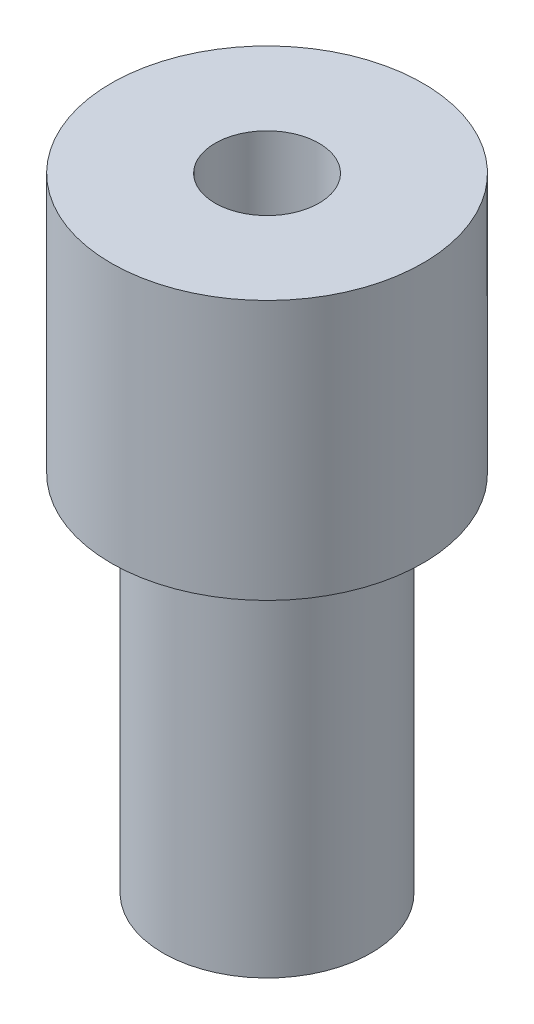
ISO-10303-21;
HEADER;
FILE_DESCRIPTION(('STEP AP214'),'2;1');
FILE_NAME('part.step','',(''),(''),'','','');
FILE_SCHEMA(('AUTOMOTIVE_DESIGN { 1 0 10303 214 1 1 1 1 }'));
ENDSEC;
DATA;
#1=APPLICATION_CONTEXT('core data for automotive mechanical design processes');
#2=APPLICATION_PROTOCOL_DEFINITION('international standard','automotive_design',2000,#1);
#3=PRODUCT_CONTEXT('',#1,'mechanical');
#4=PRODUCT('Part','Part','',(#3));
#5=PRODUCT_RELATED_PRODUCT_CATEGORY('part','',(#4));
#6=PRODUCT_DEFINITION_FORMATION('','',#4);
#7=PRODUCT_DEFINITION_CONTEXT('part definition',#1,'design');
#8=PRODUCT_DEFINITION('design','',#6,#7);
#9=PRODUCT_DEFINITION_SHAPE('','',#8);
#10=(LENGTH_UNIT() NAMED_UNIT(*) SI_UNIT(.MILLI.,.METRE.));
#11=(NAMED_UNIT(*) PLANE_ANGLE_UNIT() SI_UNIT($,.RADIAN.));
#12=(NAMED_UNIT(*) SI_UNIT($,.STERADIAN.) SOLID_ANGLE_UNIT());
#13=UNCERTAINTY_MEASURE_WITH_UNIT(LENGTH_MEASURE(1.E-05),#10,'distance_accuracy_value','');
#14=(GEOMETRIC_REPRESENTATION_CONTEXT(3) GLOBAL_UNCERTAINTY_ASSIGNED_CONTEXT((#13)) GLOBAL_UNIT_ASSIGNED_CONTEXT((#10,
#11,#12)) REPRESENTATION_CONTEXT('',''));
#15=CARTESIAN_POINT('',(0.,0.,0.));
#16=DIRECTION('',(0.,0.,1.));
#17=DIRECTION('',(1.,0.,0.));
#18=AXIS2_PLACEMENT_3D('',#15,#16,#17);
#19=CARTESIAN_POINT('',(0.,0.,0.));
#20=DIRECTION('',(0.,1.,0.));
#21=DIRECTION('',(0.,0.,1.));
#22=AXIS2_PLACEMENT_3D('',#19,#20,#21);
#23=PLANE('',#22);
#24=CARTESIAN_POINT('',(0.,0.,0.));
#25=DIRECTION('',(0.,1.,0.));
#26=DIRECTION('',(0.,0.,1.));
#27=AXIS2_PLACEMENT_3D('',#24,#25,#26);
#28=CIRCLE('',#27,4.);
#29=CARTESIAN_POINT('',(0.,0.,4.));
#30=VERTEX_POINT('',#29);
#31=EDGE_CURVE('E47',#30,#30,#28,.T.);
#32=ORIENTED_EDGE('',*,*,#31,.F.);
#33=EDGE_LOOP('',(#32));
#34=FACE_BOUND('',#33,.T.);
#35=CARTESIAN_POINT('',(0.,0.,0.));
#36=DIRECTION('',(0.,1.,0.));
#37=DIRECTION('',(0.,0.,1.));
#38=AXIS2_PLACEMENT_3D('',#35,#36,#37);
#39=CIRCLE('',#38,2.);
#40=CARTESIAN_POINT('',(0.,0.,2.));
#41=VERTEX_POINT('',#40);
#42=EDGE_CURVE('E56',#41,#41,#39,.T.);
#43=ORIENTED_EDGE('',*,*,#42,.T.);
#44=EDGE_LOOP('',(#43));
#45=FACE_BOUND('',#44,.T.);
#46=ADVANCED_FACE('F43',(#34,#45),#23,.F.);
#47=CARTESIAN_POINT('',(0.,14.,0.));
#48=DIRECTION('',(0.,-1.,0.));
#49=DIRECTION('',(0.,0.,-1.));
#50=AXIS2_PLACEMENT_3D('',#47,#48,#49);
#51=CYLINDRICAL_SURFACE('',#50,4.);
#52=CARTESIAN_POINT('',(0.,14.,0.));
#53=DIRECTION('',(0.,1.,0.));
#54=DIRECTION('',(0.,0.,1.));
#55=AXIS2_PLACEMENT_3D('',#52,#53,#54);
#56=CIRCLE('',#55,4.);
#57=CARTESIAN_POINT('',(0.,14.,4.));
#58=VERTEX_POINT('',#57);
#59=EDGE_CURVE('E10',#58,#58,#56,.T.);
#60=ORIENTED_EDGE('',*,*,#59,.F.);
#61=EDGE_LOOP('',(#60));
#62=FACE_BOUND('',#61,.T.);
#63=ORIENTED_EDGE('',*,*,#31,.T.);
#64=EDGE_LOOP('',(#63));
#65=FACE_BOUND('',#64,.T.);
#66=ADVANCED_FACE('F45',(#62,#65),#51,.T.);
#67=CARTESIAN_POINT('',(0.,14.,0.));
#68=DIRECTION('',(0.,-1.,0.));
#69=DIRECTION('',(0.,0.,-1.));
#70=AXIS2_PLACEMENT_3D('',#67,#68,#69);
#71=CYLINDRICAL_SURFACE('',#70,2.);
#72=ORIENTED_EDGE('',*,*,#42,.F.);
#73=EDGE_LOOP('',(#72));
#74=FACE_BOUND('',#73,.T.);
#75=CARTESIAN_POINT('',(0.,24.,0.));
#76=DIRECTION('',(0.,1.,0.));
#77=DIRECTION('',(0.,0.,1.));
#78=AXIS2_PLACEMENT_3D('',#75,#76,#77);
#79=CIRCLE('',#78,2.);
#80=CARTESIAN_POINT('',(0.,24.,2.));
#81=VERTEX_POINT('',#80);
#82=EDGE_CURVE('E66',#81,#81,#79,.T.);
#83=ORIENTED_EDGE('',*,*,#82,.T.);
#84=EDGE_LOOP('',(#83));
#85=FACE_BOUND('',#84,.T.);
#86=ADVANCED_FACE('F74',(#74,#85),#71,.F.);
#87=CARTESIAN_POINT('',(0.,24.,0.));
#88=DIRECTION('',(0.,1.,0.));
#89=DIRECTION('',(0.,0.,1.));
#90=AXIS2_PLACEMENT_3D('',#87,#88,#89);
#91=PLANE('',#90);
#92=CARTESIAN_POINT('',(0.,24.,0.));
#93=DIRECTION('',(0.,1.,0.));
#94=DIRECTION('',(0.,0.,1.));
#95=AXIS2_PLACEMENT_3D('',#92,#93,#94);
#96=CIRCLE('',#95,6.);
#97=CARTESIAN_POINT('',(0.,24.,6.));
#98=VERTEX_POINT('',#97);
#99=EDGE_CURVE('E61',#98,#98,#96,.T.);
#100=ORIENTED_EDGE('',*,*,#99,.T.);
#101=EDGE_LOOP('',(#100));
#102=FACE_BOUND('',#101,.T.);
#103=ORIENTED_EDGE('',*,*,#82,.F.);
#104=EDGE_LOOP('',(#103));
#105=FACE_BOUND('',#104,.T.);
#106=ADVANCED_FACE('F76',(#102,#105),#91,.T.);
#107=CARTESIAN_POINT('',(0.,14.,0.));
#108=DIRECTION('',(0.,1.,0.));
#109=DIRECTION('',(0.,0.,1.));
#110=AXIS2_PLACEMENT_3D('',#107,#108,#109);
#111=PLANE('',#110);
#112=ORIENTED_EDGE('',*,*,#59,.T.);
#113=EDGE_LOOP('',(#112));
#114=FACE_BOUND('',#113,.T.);
#115=CARTESIAN_POINT('',(0.,14.,0.));
#116=DIRECTION('',(0.,1.,0.));
#117=DIRECTION('',(0.,0.,1.));
#118=AXIS2_PLACEMENT_3D('',#115,#116,#117);
#119=CIRCLE('',#118,6.);
#120=CARTESIAN_POINT('',(0.,14.,6.));
#121=VERTEX_POINT('',#120);
#122=EDGE_CURVE('E62',#121,#121,#119,.T.);
#123=ORIENTED_EDGE('',*,*,#122,.F.);
#124=EDGE_LOOP('',(#123));
#125=FACE_BOUND('',#124,.T.);
#126=ADVANCED_FACE('F78',(#114,#125),#111,.F.);
#127=CARTESIAN_POINT('',(0.,24.,0.));
#128=DIRECTION('',(0.,-1.,0.));
#129=DIRECTION('',(0.,0.,-1.));
#130=AXIS2_PLACEMENT_3D('',#127,#128,#129);
#131=CYLINDRICAL_SURFACE('',#130,6.);
#132=ORIENTED_EDGE('',*,*,#99,.F.);
#133=EDGE_LOOP('',(#132));
#134=FACE_BOUND('',#133,.T.);
#135=ORIENTED_EDGE('',*,*,#122,.T.);
#136=EDGE_LOOP('',(#135));
#137=FACE_BOUND('',#136,.T.);
#138=ADVANCED_FACE('F85',(#134,#137),#131,.T.);
#139=CLOSED_SHELL('',(#46,#66,#86,#106,#126,#138));
#140=MANIFOLD_SOLID_BREP('B2',#139);
#141=ADVANCED_BREP_SHAPE_REPRESENTATION('',(#18,#140),#14);
#142=SHAPE_DEFINITION_REPRESENTATION(#9,#141);
ENDSEC;
END-ISO-10303-21;
